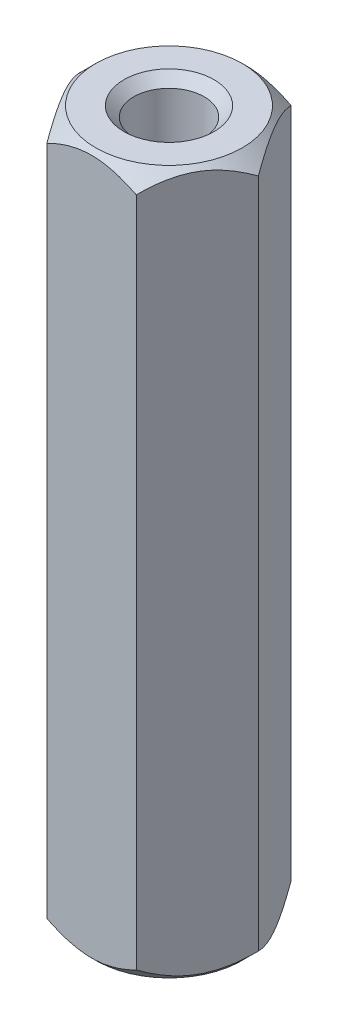
ISO-10303-21;
HEADER;
FILE_DESCRIPTION(('STEP AP214'),'2;1');
FILE_NAME('part.step','',(''),(''),'','','');
FILE_SCHEMA(('AUTOMOTIVE_DESIGN { 1 0 10303 214 1 1 1 1 }'));
ENDSEC;
DATA;
#1=APPLICATION_CONTEXT('core data for automotive mechanical design processes');
#2=APPLICATION_PROTOCOL_DEFINITION('international standard','automotive_design',2000,#1);
#3=PRODUCT_CONTEXT('',#1,'mechanical');
#4=PRODUCT('Part','Part','',(#3));
#5=PRODUCT_RELATED_PRODUCT_CATEGORY('part','',(#4));
#6=PRODUCT_DEFINITION_FORMATION('','',#4);
#7=PRODUCT_DEFINITION_CONTEXT('part definition',#1,'design');
#8=PRODUCT_DEFINITION('design','',#6,#7);
#9=PRODUCT_DEFINITION_SHAPE('','',#8);
#10=(LENGTH_UNIT() NAMED_UNIT(*) SI_UNIT(.MILLI.,.METRE.));
#11=(NAMED_UNIT(*) PLANE_ANGLE_UNIT() SI_UNIT($,.RADIAN.));
#12=(NAMED_UNIT(*) SI_UNIT($,.STERADIAN.) SOLID_ANGLE_UNIT());
#13=UNCERTAINTY_MEASURE_WITH_UNIT(LENGTH_MEASURE(1.E-05),#10,'distance_accuracy_value','');
#14=(GEOMETRIC_REPRESENTATION_CONTEXT(3) GLOBAL_UNCERTAINTY_ASSIGNED_CONTEXT((#13)) GLOBAL_UNIT_ASSIGNED_CONTEXT((#10,
#11,#12)) REPRESENTATION_CONTEXT('',''));
#15=CARTESIAN_POINT('',(0.,0.,0.));
#16=DIRECTION('',(0.,0.,1.));
#17=DIRECTION('',(1.,0.,0.));
#18=AXIS2_PLACEMENT_3D('',#15,#16,#17);
#19=CARTESIAN_POINT('',(3.17542648054294,25.,0.));
#20=DIRECTION('',(-0.866025403784439,0.,0.5));
#21=DIRECTION('',(0.5,0.,0.866025403784439));
#22=AXIS2_PLACEMENT_3D('',#19,#20,#21);
#23=PLANE('',#22);
#24=CARTESIAN_POINT('',(3.17554195059678,24.4244580431051,0.000199999999999451));
#25=CARTESIAN_POINT('',(3.12096451019372,24.4789890063512,-0.0943308997251552));
#26=CARTESIAN_POINT('',(3.06547446347007,24.5303172884173,-0.190442479964885));
#27=CARTESIAN_POINT('',(2.95232415552349,24.6242981519194,-0.386424562220434));
#28=CARTESIAN_POINT('',(2.89465313346251,24.6668984427094,-0.486313702554481));
#29=CARTESIAN_POINT('',(2.77836227110502,24.7398735719351,-0.687735384613654));
#30=CARTESIAN_POINT('',(2.71977204694418,24.7704318303217,-0.78921662968707));
#31=CARTESIAN_POINT('',(2.60130175305013,24.8175131640141,-0.994413197899191));
#32=CARTESIAN_POINT('',(2.54142530239376,24.8340713841007,-1.0981222526129));
#33=CARTESIAN_POINT('',(2.43823122487548,24.8490111921236,-1.27685963791477));
#34=CARTESIAN_POINT('',(2.3950469127149,24.8512227473998,-1.35165706066681));
#35=CARTESIAN_POINT('',(2.30874888176717,24.8474967824125,-1.50112963486143));
#36=CARTESIAN_POINT('',(2.26563519303235,24.8415564052911,-1.57580473425185));
#37=CARTESIAN_POINT('',(2.17981491306543,24.8218646203966,-1.72444981947434));
#38=CARTESIAN_POINT('',(2.13710883164784,24.8081044750726,-1.79841892228177));
#39=CARTESIAN_POINT('',(2.05243516150698,24.7735284813848,-1.94507802102908));
#40=CARTESIAN_POINT('',(2.01046751642766,24.7527131739356,-2.01776811458047));
#41=CARTESIAN_POINT('',(1.902972667594,24.6909197287516,-2.20395465431231));
#42=CARTESIAN_POINT('',(1.83811191884127,24.6452841914761,-2.31629676656899));
#43=CARTESIAN_POINT('',(1.74273981029544,24.5682453606757,-2.48148610419534));
#44=CARTESIAN_POINT('',(1.71131043208802,24.54117749248,-2.53592338410089));
#45=CARTESIAN_POINT('',(1.64903383378715,24.4845743483067,-2.64378961648056));
#46=CARTESIAN_POINT('',(1.61818627041469,24.4550405868641,-2.69721916353136));
#47=CARTESIAN_POINT('',(1.58759777021763,24.4244580431051,-2.7502));
#48=B_SPLINE_CURVE_WITH_KNOTS('',3,(#24,#25,#26,#27,#28,#29,#30,#31,#32,#33,#34,#35,#36,#37,#38,
#39,#40,#41,#42,#43,#44,#45,#46,#47),.UNSPECIFIED.,.F.,.F.,(4,2,2,2,2,2,2,2,2,2,2,4),(0.,
0.366307821078207,0.73474990222977,1.0973403616594,1.45901787214335,1.71784182927396,
1.97675651485028,2.23596107357798,2.49514576375465,2.90682558871159,3.11210731416954,
3.31726387159445),.UNSPECIFIED.);
#49=CARTESIAN_POINT('',(3.17542648054294,24.4245735194571,0.));
#50=VERTEX_POINT('',#49);
#51=CARTESIAN_POINT('',(1.58771324027147,24.4245735194571,-2.75));
#52=VERTEX_POINT('',#51);
#53=EDGE_CURVE('E193',#50,#52,#48,.T.);
#54=ORIENTED_EDGE('',*,*,#53,.F.);
#55=DIRECTION('',(0.,-1.,0.));
#56=VECTOR('',#55,1.);
#57=CARTESIAN_POINT('',(3.17542648054294,25.,0.));
#58=LINE('',#57,#56);
#59=CARTESIAN_POINT('',(3.17542648054294,0.575426480542932,0.));
#60=VERTEX_POINT('',#59);
#61=EDGE_CURVE('E58',#50,#60,#58,.T.);
#62=ORIENTED_EDGE('',*,*,#61,.T.);
#63=CARTESIAN_POINT('',(1.58759777021763,0.575541956894908,-2.7502));
#64=CARTESIAN_POINT('',(1.64217521062069,0.521010993648786,-2.65566910027484));
#65=CARTESIAN_POINT('',(1.69766525734433,0.469682711582689,-2.55955752003512));
#66=CARTESIAN_POINT('',(1.81081556529092,0.375701848080574,-2.36357543777957));
#67=CARTESIAN_POINT('',(1.8684865873519,0.333101557290606,-2.26368629744552));
#68=CARTESIAN_POINT('',(1.98477744970939,0.260126428064943,-2.06226461538635));
#69=CARTESIAN_POINT('',(2.04336767387023,0.229568169678274,-1.96078337031293));
#70=CARTESIAN_POINT('',(2.16183796776428,0.18248683598589,-1.75558680210081));
#71=CARTESIAN_POINT('',(2.22171441842064,0.165928615899292,-1.6518777473871));
#72=CARTESIAN_POINT('',(2.32490849593893,0.150988807876365,-1.47314036208524));
#73=CARTESIAN_POINT('',(2.36809280809951,0.148777252600221,-1.3983429393332));
#74=CARTESIAN_POINT('',(2.45439083904724,0.152503217587472,-1.24887036513858));
#75=CARTESIAN_POINT('',(2.49750452778206,0.158443594708872,-1.17419526574816));
#76=CARTESIAN_POINT('',(2.58332480774898,0.178135379603437,-1.02555018052567));
#77=CARTESIAN_POINT('',(2.62603088916656,0.19189552492741,-0.951581077718235));
#78=CARTESIAN_POINT('',(2.71070455930743,0.226471518615216,-0.804921978970924));
#79=CARTESIAN_POINT('',(2.75267220438674,0.247286826064364,-0.732231885419538));
#80=CARTESIAN_POINT('',(2.86016705322041,0.309080271248451,-0.546045345687696));
#81=CARTESIAN_POINT('',(2.92502780197313,0.35471580852391,-0.433703233431014));
#82=CARTESIAN_POINT('',(3.02039991051896,0.431754639324315,-0.268513895804662));
#83=CARTESIAN_POINT('',(3.05182928872638,0.458822507519961,-0.214076615899113));
#84=CARTESIAN_POINT('',(3.11410588702726,0.515425651693308,-0.106210383519438));
#85=CARTESIAN_POINT('',(3.14495345039972,0.544959413135855,-0.0527808364686397));
#86=CARTESIAN_POINT('',(3.17554195059678,0.575541956894908,0.000199999999999562));
#87=B_SPLINE_CURVE_WITH_KNOTS('',3,(#63,#64,#65,#66,#67,#68,#69,#70,#71,#72,#73,#74,#75,#76,#77,
#78,#79,#80,#81,#82,#83,#84,#85,#86),.UNSPECIFIED.,.F.,.F.,(4,2,2,2,2,2,2,2,2,2,2,4),(0.,
0.366307821078206,0.734749902229767,1.09734036165939,1.45901787214335,1.71784182927396,
1.97675651485027,2.23596107357798,2.49514576375464,2.90682558871159,3.11210731416953,
3.31726387159445),.UNSPECIFIED.);
#88=CARTESIAN_POINT('',(1.58771324027147,0.575426480542932,-2.75));
#89=VERTEX_POINT('',#88);
#90=EDGE_CURVE('E127',#89,#60,#87,.T.);
#91=ORIENTED_EDGE('',*,*,#90,.F.);
#92=DIRECTION('',(0.,-1.,0.));
#93=VECTOR('',#92,1.);
#94=CARTESIAN_POINT('',(1.58771324027147,25.,-2.75));
#95=LINE('',#94,#93);
#96=EDGE_CURVE('E11',#52,#89,#95,.T.);
#97=ORIENTED_EDGE('',*,*,#96,.F.);
#98=EDGE_LOOP('',(#54,#62,#91,#97));
#99=FACE_BOUND('',#98,.T.);
#100=ADVANCED_FACE('F35',(#99),#23,.F.);
#101=CARTESIAN_POINT('',(1.58771324027147,25.,-2.75));
#102=DIRECTION('',(0.,0.,1.));
#103=DIRECTION('',(1.,0.,0.));
#104=AXIS2_PLACEMENT_3D('',#101,#102,#103);
#105=PLANE('',#104);
#106=CARTESIAN_POINT('',(-3.25318446766894,23.340221932931,-2.75));
#107=CARTESIAN_POINT('',(-3.17435132632785,23.4004130612774,-2.75));
#108=CARTESIAN_POINT('',(-3.09508664432669,23.4600480039978,-2.75));
#109=CARTESIAN_POINT('',(-2.93552029499848,23.5779534640375,-2.75));
#110=CARTESIAN_POINT('',(-2.85521838100221,23.6362236471701,-2.75));
#111=CARTESIAN_POINT('',(-2.69281633076979,23.7515622578085,-2.75));
#112=CARTESIAN_POINT('',(-2.6107070916643,23.808617910593,-2.75));
#113=CARTESIAN_POINT('',(-2.44511064746396,23.9206864718193,-2.75));
#114=CARTESIAN_POINT('',(-2.36162353877531,23.9756995223093,-2.75));
#115=CARTESIAN_POINT('',(-2.18790389112894,24.08650082828,-2.75));
#116=CARTESIAN_POINT('',(-2.09757049076991,24.1421317465607,-2.75));
#117=CARTESIAN_POINT('',(-1.91481340119805,24.2498417776052,-2.75));
#118=CARTESIAN_POINT('',(-1.82238998788238,24.3019213555694,-2.75));
#119=CARTESIAN_POINT('',(-1.6354019230151,24.4014391399425,-2.75));
#120=CARTESIAN_POINT('',(-1.54084424527055,24.4488903471598,-2.75));
#121=CARTESIAN_POINT('',(-1.3490933630534,24.5380798463973,-2.75));
#122=CARTESIAN_POINT('',(-1.25190140716265,24.5798207901081,-2.75));
#123=CARTESIAN_POINT('',(-1.06371723723787,24.6525985160094,-2.75));
#124=CARTESIAN_POINT('',(-0.972971140610649,24.6842651782299,-2.75));
#125=CARTESIAN_POINT('',(-0.789218425830063,24.7403290297576,-2.75));
#126=CARTESIAN_POINT('',(-0.696211659611728,24.7647257415166,-2.75));
#127=CARTESIAN_POINT('',(-0.510082611526426,24.8045422828022,-2.75));
#128=CARTESIAN_POINT('',(-0.416994968077464,24.8201213471438,-2.75));
#129=CARTESIAN_POINT('',(-0.229728689201748,24.8419863205344,-2.75));
#130=CARTESIAN_POINT('',(-0.135550267120603,24.8482740169509,-2.75));
#131=CARTESIAN_POINT('',(0.049132532414904,24.8510484151696,-2.75));
#132=CARTESIAN_POINT('',(0.139631188652713,24.8479218469063,-2.75));
#133=CARTESIAN_POINT('',(0.319894261401458,24.8329148434665,-2.75));
#134=CARTESIAN_POINT('',(0.409658608431552,24.8210335893849,-2.75));
#135=CARTESIAN_POINT('',(0.589325943025652,24.7889782763205,-2.75));
#136=CARTESIAN_POINT('',(0.679202808490498,24.7686599869486,-2.75));
#137=CARTESIAN_POINT('',(0.856977323722658,24.7208365857239,-2.75));
#138=CARTESIAN_POINT('',(0.944875107630336,24.6933319625569,-2.75));
#139=CARTESIAN_POINT('',(1.2178117022278,24.5974817056055,-2.75));
#140=CARTESIAN_POINT('',(1.39908624348775,24.5183802224201,-2.75));
#141=CARTESIAN_POINT('',(1.6643778514059,24.3864700289548,-2.75));
#142=CARTESIAN_POINT('',(1.75186873700446,24.3401872657413,-2.75));
#143=CARTESIAN_POINT('',(1.92486730737521,24.2440446048772,-2.75));
#144=CARTESIAN_POINT('',(2.0103753406011,24.1941853421389,-2.75));
#145=CARTESIAN_POINT('',(2.17545095590652,24.0941484078715,-2.75));
#146=CARTESIAN_POINT('',(2.25510307682408,24.0441086598986,-2.75));
#147=CARTESIAN_POINT('',(2.41304093731651,23.9419071055646,-2.75));
#148=CARTESIAN_POINT('',(2.49132657339064,23.8897451394499,-2.75));
#149=CARTESIAN_POINT('',(2.64607675927998,23.7841062512369,-2.75));
#150=CARTESIAN_POINT('',(2.72255090392029,23.7306433262937,-2.75));
#151=CARTESIAN_POINT('',(2.87445148235092,23.6222912546725,-2.75));
#152=CARTESIAN_POINT('',(2.94987819895079,23.5674025049325,-2.75));
#153=CARTESIAN_POINT('',(3.02486603543437,23.5119302192447,-2.75));
#154=B_SPLINE_CURVE_WITH_KNOTS('',3,(#106,#107,#108,#109,#110,#111,#112,#113,#114,#115,#116,
#117,#118,#119,#120,#121,#122,#123,#124,#125,#126,#127,#128,#129,#130,#131,#132,#133,#134,#135,
#136,#137,#138,#139,#140,#141,#142,#143,#144,#145,#146,#147,#148,#149,#150,#151,#152,#153),
.UNSPECIFIED.,.F.,.F.,(4,2,2,2,2,2,2,2,2,2,2,2,2,2,2,2,2,2,2,2,2,2,2,4),(0.,0.297560205375837,
0.595192527837748,0.895126020648953,1.19503861606652,1.51324189540341,1.83140341197327,
2.1486438129796,2.46573639246571,2.75382380349614,3.04193013423482,3.32465250604355,
3.60732048386056,3.87853727370559,4.14977943613652,4.42586290772333,4.70192760994482,
5.29343447193664,5.59034540950354,5.88720376825973,6.169367939813,6.45155339120154,
6.73146312156414,7.01129574525014),.UNSPECIFIED.);
#155=CARTESIAN_POINT('',(-1.58771324027147,24.4245735194571,-2.75));
#156=VERTEX_POINT('',#155);
#157=EDGE_CURVE('E92',#52,#156,#154,.F.);
#158=ORIENTED_EDGE('',*,*,#157,.F.);
#159=ORIENTED_EDGE('',*,*,#96,.T.);
#160=CARTESIAN_POINT('',(-3.25318446766894,1.65977806706902,-2.75));
#161=CARTESIAN_POINT('',(-3.17435132632785,1.59958693872261,-2.75));
#162=CARTESIAN_POINT('',(-3.09508664432669,1.53995199600224,-2.75));
#163=CARTESIAN_POINT('',(-2.93552029499848,1.42204653596247,-2.75));
#164=CARTESIAN_POINT('',(-2.85521838100221,1.36377635282993,-2.75));
#165=CARTESIAN_POINT('',(-2.69281633076979,1.24843774219145,-2.75));
#166=CARTESIAN_POINT('',(-2.6107070916643,1.19138208940703,-2.75));
#167=CARTESIAN_POINT('',(-2.44511064746396,1.07931352818069,-2.75));
#168=CARTESIAN_POINT('',(-2.36162353877531,1.02430047769075,-2.75));
#169=CARTESIAN_POINT('',(-2.18790389112894,0.913499171720041,-2.75));
#170=CARTESIAN_POINT('',(-2.09757049076991,0.857868253439277,-2.75));
#171=CARTESIAN_POINT('',(-1.91481340119805,0.750158222394771,-2.75));
#172=CARTESIAN_POINT('',(-1.82238998788238,0.698078644430596,-2.75));
#173=CARTESIAN_POINT('',(-1.6354019230151,0.598560860057509,-2.75));
#174=CARTESIAN_POINT('',(-1.54084424527055,0.551109652840225,-2.75));
#175=CARTESIAN_POINT('',(-1.3490933630534,0.461920153602751,-2.75));
#176=CARTESIAN_POINT('',(-1.25190140716265,0.420179209891871,-2.75));
#177=CARTESIAN_POINT('',(-1.06371723723787,0.347401483990568,-2.75));
#178=CARTESIAN_POINT('',(-0.972971140610649,0.31573482177011,-2.75));
#179=CARTESIAN_POINT('',(-0.789218425830063,0.259670970242376,-2.75));
#180=CARTESIAN_POINT('',(-0.696211659611728,0.235274258483399,-2.75));
#181=CARTESIAN_POINT('',(-0.510082611526426,0.195457717197765,-2.75));
#182=CARTESIAN_POINT('',(-0.416994968077464,0.179878652856208,-2.75));
#183=CARTESIAN_POINT('',(-0.229728689201749,0.158013679465602,-2.75));
#184=CARTESIAN_POINT('',(-0.135550267120603,0.151725983049063,-2.75));
#185=CARTESIAN_POINT('',(0.0491325324149033,0.148951584830425,-2.75));
#186=CARTESIAN_POINT('',(0.139631188652713,0.152078153093695,-2.75));
#187=CARTESIAN_POINT('',(0.319894261401457,0.16708515653347,-2.75));
#188=CARTESIAN_POINT('',(0.409658608431551,0.178966410615099,-2.75));
#189=CARTESIAN_POINT('',(0.589325943025652,0.211021723679476,-2.75));
#190=CARTESIAN_POINT('',(0.679202808490497,0.231340013051435,-2.75));
#191=CARTESIAN_POINT('',(0.856977323722657,0.27916341427606,-2.75));
#192=CARTESIAN_POINT('',(0.944875107630335,0.306668037443103,-2.75));
#193=CARTESIAN_POINT('',(1.2178117022278,0.402518294394536,-2.75));
#194=CARTESIAN_POINT('',(1.39908624348775,0.48161977757989,-2.75));
#195=CARTESIAN_POINT('',(1.6643778514059,0.613529971045228,-2.75));
#196=CARTESIAN_POINT('',(1.75186873700445,0.659812734258722,-2.75));
#197=CARTESIAN_POINT('',(1.92486730737521,0.755955395122828,-2.75));
#198=CARTESIAN_POINT('',(2.0103753406011,0.805814657861119,-2.75));
#199=CARTESIAN_POINT('',(2.17545095590652,0.905851592128464,-2.75));
#200=CARTESIAN_POINT('',(2.25510307682408,0.955891340101416,-2.75));
#201=CARTESIAN_POINT('',(2.41304093731651,1.05809289443541,-2.75));
#202=CARTESIAN_POINT('',(2.49132657339064,1.11025486055007,-2.75));
#203=CARTESIAN_POINT('',(2.64607675927998,1.21589374876306,-2.75));
#204=CARTESIAN_POINT('',(2.7225509039203,1.26935667370632,-2.75));
#205=CARTESIAN_POINT('',(2.87445148235092,1.37770874532753,-2.75));
#206=CARTESIAN_POINT('',(2.94987819895079,1.43259749506751,-2.75));
#207=CARTESIAN_POINT('',(3.02486603543437,1.48806978075526,-2.75));
#208=B_SPLINE_CURVE_WITH_KNOTS('',3,(#160,#161,#162,#163,#164,#165,#166,#167,#168,#169,#170,
#171,#172,#173,#174,#175,#176,#177,#178,#179,#180,#181,#182,#183,#184,#185,#186,#187,#188,#189,
#190,#191,#192,#193,#194,#195,#196,#197,#198,#199,#200,#201,#202,#203,#204,#205,#206,#207),
.UNSPECIFIED.,.F.,.F.,(4,2,2,2,2,2,2,2,2,2,2,2,2,2,2,2,2,2,2,2,2,2,2,4),(0.,0.297560205375841,
0.59519252783775,0.895126020648954,1.19503861606652,1.51324189540341,1.83140341197328,
2.1486438129796,2.46573639246571,2.75382380349615,3.04193013423482,3.32465250604355,
3.60732048386056,3.87853727370559,4.14977943613652,4.42586290772333,4.70192760994482,
5.29343447193664,5.59034540950354,5.88720376825973,6.169367939813,6.45155339120155,
6.73146312156414,7.01129574525014),.UNSPECIFIED.);
#209=CARTESIAN_POINT('',(-1.58771324027147,0.575426480542932,-2.75));
#210=VERTEX_POINT('',#209);
#211=EDGE_CURVE('E133',#210,#89,#208,.T.);
#212=ORIENTED_EDGE('',*,*,#211,.F.);
#213=DIRECTION('',(0.,-1.,0.));
#214=VECTOR('',#213,1.);
#215=CARTESIAN_POINT('',(-1.58771324027147,25.,-2.75));
#216=LINE('',#215,#214);
#217=EDGE_CURVE('E43',#156,#210,#216,.T.);
#218=ORIENTED_EDGE('',*,*,#217,.F.);
#219=EDGE_LOOP('',(#158,#159,#212,#218));
#220=FACE_BOUND('',#219,.T.);
#221=ADVANCED_FACE('F177',(#220),#105,.F.);
#222=CARTESIAN_POINT('',(-1.58771324027147,25.,-2.75));
#223=DIRECTION('',(0.866025403784439,0.,0.5));
#224=DIRECTION('',(0.5,0.,-0.866025403784439));
#225=AXIS2_PLACEMENT_3D('',#222,#223,#224);
#226=PLANE('',#225);
#227=CARTESIAN_POINT('',(-1.58759777021763,24.4244580431051,-2.7502));
#228=CARTESIAN_POINT('',(-1.64217521062069,24.4789890063512,-2.65566910027484));
#229=CARTESIAN_POINT('',(-1.69766525734434,24.5303172884173,-2.55955752003511));
#230=CARTESIAN_POINT('',(-1.81081556529092,24.6242981519194,-2.36357543777957));
#231=CARTESIAN_POINT('',(-1.8684865873519,24.6668984427094,-2.26368629744552));
#232=CARTESIAN_POINT('',(-1.98477744970939,24.7398735719351,-2.06226461538635));
#233=CARTESIAN_POINT('',(-2.04336767387023,24.7704318303217,-1.96078337031293));
#234=CARTESIAN_POINT('',(-2.16183796776428,24.8175131640141,-1.75558680210081));
#235=CARTESIAN_POINT('',(-2.22171441842064,24.8340713841007,-1.6518777473871));
#236=CARTESIAN_POINT('',(-2.32490849593893,24.8490111921236,-1.47314036208524));
#237=CARTESIAN_POINT('',(-2.36809280809951,24.8512227473998,-1.3983429393332));
#238=CARTESIAN_POINT('',(-2.45439083904724,24.8474967824125,-1.24887036513858));
#239=CARTESIAN_POINT('',(-2.49750452778206,24.8415564052911,-1.17419526574816));
#240=CARTESIAN_POINT('',(-2.58332480774898,24.8218646203966,-1.02555018052566));
#241=CARTESIAN_POINT('',(-2.62603088916656,24.8081044750726,-0.951581077718232));
#242=CARTESIAN_POINT('',(-2.71070455930743,24.7735284813848,-0.804921978970922));
#243=CARTESIAN_POINT('',(-2.75267220438674,24.7527131739356,-0.732231885419535));
#244=CARTESIAN_POINT('',(-2.86016705322041,24.6909197287516,-0.546045345687693));
#245=CARTESIAN_POINT('',(-2.92502780197313,24.6452841914761,-0.433703233431012));
#246=CARTESIAN_POINT('',(-3.02039991051896,24.5682453606757,-0.26851389580466));
#247=CARTESIAN_POINT('',(-3.05182928872638,24.54117749248,-0.214076615899112));
#248=CARTESIAN_POINT('',(-3.11410588702726,24.4845743483067,-0.106210383519437));
#249=CARTESIAN_POINT('',(-3.14495345039972,24.4550405868641,-0.0527808364686385));
#250=CARTESIAN_POINT('',(-3.17554195059678,24.4244580431051,0.000200000000000208));
#251=B_SPLINE_CURVE_WITH_KNOTS('',3,(#227,#228,#229,#230,#231,#232,#233,#234,#235,#236,#237,
#238,#239,#240,#241,#242,#243,#244,#245,#246,#247,#248,#249,#250),.UNSPECIFIED.,.F.,.F.,(4,2,2,
2,2,2,2,2,2,2,2,4),(0.,0.366307821078205,0.734749902229767,1.09734036165939,1.45901787214335,
1.71784182927396,1.97675651485028,2.23596107357798,2.49514576375464,2.90682558871159,
3.11210731416953,3.31726387159444),.UNSPECIFIED.);
#252=CARTESIAN_POINT('',(-3.17542648054294,24.4245735194571,0.));
#253=VERTEX_POINT('',#252);
#254=EDGE_CURVE('E87',#156,#253,#251,.T.);
#255=ORIENTED_EDGE('',*,*,#254,.F.);
#256=ORIENTED_EDGE('',*,*,#217,.T.);
#257=CARTESIAN_POINT('',(-3.17554195059678,0.575541956894907,0.000200000000001098));
#258=CARTESIAN_POINT('',(-3.12096451019372,0.521010993648785,-0.0943308997251537));
#259=CARTESIAN_POINT('',(-3.06547446347007,0.469682711582688,-0.190442479964884));
#260=CARTESIAN_POINT('',(-2.95232415552349,0.375701848080573,-0.386424562220433));
#261=CARTESIAN_POINT('',(-2.89465313346251,0.333101557290605,-0.486313702554479));
#262=CARTESIAN_POINT('',(-2.77836227110502,0.260126428064943,-0.687735384613651));
#263=CARTESIAN_POINT('',(-2.71977204694418,0.229568169678274,-0.789216629687066));
#264=CARTESIAN_POINT('',(-2.60130175305013,0.18248683598589,-0.994413197899185));
#265=CARTESIAN_POINT('',(-2.54142530239377,0.165928615899292,-1.0981222526129));
#266=CARTESIAN_POINT('',(-2.43823122487548,0.150988807876365,-1.27685963791476));
#267=CARTESIAN_POINT('',(-2.3950469127149,0.148777252600221,-1.3516570606668));
#268=CARTESIAN_POINT('',(-2.30874888176717,0.152503217587472,-1.50112963486142));
#269=CARTESIAN_POINT('',(-2.26563519303235,0.158443594708872,-1.57580473425184));
#270=CARTESIAN_POINT('',(-2.17981491306543,0.178135379603437,-1.72444981947433));
#271=CARTESIAN_POINT('',(-2.13710883164785,0.19189552492741,-1.79841892228176));
#272=CARTESIAN_POINT('',(-2.05243516150698,0.226471518615216,-1.94507802102908));
#273=CARTESIAN_POINT('',(-2.01046751642767,0.247286826064364,-2.01776811458046));
#274=CARTESIAN_POINT('',(-1.902972667594,0.309080271248451,-2.2039546543123));
#275=CARTESIAN_POINT('',(-1.83811191884128,0.354715808523911,-2.31629676656898));
#276=CARTESIAN_POINT('',(-1.74273981029545,0.431754639324316,-2.48148610419534));
#277=CARTESIAN_POINT('',(-1.71131043208803,0.458822507519961,-2.53592338410089));
#278=CARTESIAN_POINT('',(-1.64903383378715,0.515425651693308,-2.64378961648056));
#279=CARTESIAN_POINT('',(-1.61818627041469,0.544959413135855,-2.69721916353136));
#280=CARTESIAN_POINT('',(-1.58759777021763,0.575541956894908,-2.7502));
#281=B_SPLINE_CURVE_WITH_KNOTS('',3,(#257,#258,#259,#260,#261,#262,#263,#264,#265,#266,#267,
#268,#269,#270,#271,#272,#273,#274,#275,#276,#277,#278,#279,#280),.UNSPECIFIED.,.F.,.F.,(4,2,2,
2,2,2,2,2,2,2,2,4),(0.,0.366307821078206,0.734749902229767,1.09734036165939,1.45901787214335,
1.71784182927395,1.97675651485027,2.23596107357798,2.49514576375464,2.90682558871159,
3.11210731416953,3.31726387159444),.UNSPECIFIED.);
#282=CARTESIAN_POINT('',(-3.17542648054294,0.575426480542932,0.));
#283=VERTEX_POINT('',#282);
#284=EDGE_CURVE('E108',#283,#210,#281,.T.);
#285=ORIENTED_EDGE('',*,*,#284,.F.);
#286=DIRECTION('',(0.,-1.,0.));
#287=VECTOR('',#286,1.);
#288=CARTESIAN_POINT('',(-3.17542648054294,25.,0.));
#289=LINE('',#288,#287);
#290=EDGE_CURVE('E101',#253,#283,#289,.T.);
#291=ORIENTED_EDGE('',*,*,#290,.F.);
#292=EDGE_LOOP('',(#255,#256,#285,#291));
#293=FACE_BOUND('',#292,.T.);
#294=ADVANCED_FACE('F106',(#293),#226,.F.);
#295=CARTESIAN_POINT('',(-3.17542648054294,25.,0.));
#296=DIRECTION('',(0.866025403784438,0.,-0.5));
#297=DIRECTION('',(-0.5,0.,-0.866025403784438));
#298=AXIS2_PLACEMENT_3D('',#295,#296,#297);
#299=PLANE('',#298);
#300=CARTESIAN_POINT('',(-3.17554195059678,24.4244580431051,-0.000199999999999042));
#301=CARTESIAN_POINT('',(-3.12096451019372,24.4789890063512,0.0943308997251558));
#302=CARTESIAN_POINT('',(-3.06547446347007,24.5303172884173,0.190442479964885));
#303=CARTESIAN_POINT('',(-2.95232415552349,24.6242981519194,0.386424562220433));
#304=CARTESIAN_POINT('',(-2.89465313346251,24.6668984427094,0.48631370255448));
#305=CARTESIAN_POINT('',(-2.77836227110502,24.7398735719351,0.687735384613652));
#306=CARTESIAN_POINT('',(-2.71977204694418,24.7704318303217,0.789216629687068));
#307=CARTESIAN_POINT('',(-2.60130175305013,24.8175131640141,0.994413197899187));
#308=CARTESIAN_POINT('',(-2.54142530239377,24.8340713841007,1.0981222526129));
#309=CARTESIAN_POINT('',(-2.43823122487548,24.8490111921236,1.27685963791476));
#310=CARTESIAN_POINT('',(-2.3950469127149,24.8512227473998,1.3516570606668));
#311=CARTESIAN_POINT('',(-2.30874888176717,24.8474967824125,1.50112963486142));
#312=CARTESIAN_POINT('',(-2.26563519303235,24.8415564052911,1.57580473425184));
#313=CARTESIAN_POINT('',(-2.17981491306543,24.8218646203966,1.72444981947433));
#314=CARTESIAN_POINT('',(-2.13710883164785,24.8081044750726,1.79841892228177));
#315=CARTESIAN_POINT('',(-2.05243516150698,24.7735284813848,1.94507802102908));
#316=CARTESIAN_POINT('',(-2.01046751642767,24.7527131739356,2.01776811458046));
#317=CARTESIAN_POINT('',(-1.902972667594,24.6909197287516,2.2039546543123));
#318=CARTESIAN_POINT('',(-1.83811191884128,24.6452841914761,2.31629676656899));
#319=CARTESIAN_POINT('',(-1.74273981029544,24.5682453606757,2.48148610419534));
#320=CARTESIAN_POINT('',(-1.71131043208802,24.54117749248,2.53592338410089));
#321=CARTESIAN_POINT('',(-1.64903383378715,24.4845743483067,2.64378961648056));
#322=CARTESIAN_POINT('',(-1.61818627041469,24.4550405868641,2.69721916353136));
#323=CARTESIAN_POINT('',(-1.58759777021763,24.4244580431051,2.7502));
#324=B_SPLINE_CURVE_WITH_KNOTS('',3,(#300,#301,#302,#303,#304,#305,#306,#307,#308,#309,#310,
#311,#312,#313,#314,#315,#316,#317,#318,#319,#320,#321,#322,#323),.UNSPECIFIED.,.F.,.F.,(4,2,2,
2,2,2,2,2,2,2,2,4),(0.,0.366307821078205,0.734749902229766,1.09734036165939,1.45901787214335,
1.71784182927396,1.97675651485027,2.23596107357798,2.49514576375464,2.90682558871159,
3.11210731416953,3.31726387159444),.UNSPECIFIED.);
#325=CARTESIAN_POINT('',(-1.58771324027146,24.4245735194571,2.75));
#326=VERTEX_POINT('',#325);
#327=EDGE_CURVE('E90',#253,#326,#324,.T.);
#328=ORIENTED_EDGE('',*,*,#327,.F.);
#329=ORIENTED_EDGE('',*,*,#290,.T.);
#330=CARTESIAN_POINT('',(-1.58759777021763,0.575541956894908,2.7502));
#331=CARTESIAN_POINT('',(-1.64217521062069,0.521010993648786,2.65566910027484));
#332=CARTESIAN_POINT('',(-1.69766525734433,0.469682711582688,2.55955752003512));
#333=CARTESIAN_POINT('',(-1.81081556529092,0.375701848080573,2.36357543777957));
#334=CARTESIAN_POINT('',(-1.8684865873519,0.333101557290605,2.26368629744552));
#335=CARTESIAN_POINT('',(-1.98477744970939,0.260126428064943,2.06226461538635));
#336=CARTESIAN_POINT('',(-2.04336767387023,0.229568169678273,1.96078337031293));
#337=CARTESIAN_POINT('',(-2.16183796776428,0.18248683598589,1.75558680210081));
#338=CARTESIAN_POINT('',(-2.22171441842064,0.165928615899291,1.6518777473871));
#339=CARTESIAN_POINT('',(-2.32490849593893,0.150988807876364,1.47314036208524));
#340=CARTESIAN_POINT('',(-2.36809280809951,0.148777252600221,1.3983429393332));
#341=CARTESIAN_POINT('',(-2.45439083904724,0.152503217587472,1.24887036513858));
#342=CARTESIAN_POINT('',(-2.49750452778206,0.158443594708872,1.17419526574816));
#343=CARTESIAN_POINT('',(-2.58332480774898,0.178135379603437,1.02555018052566));
#344=CARTESIAN_POINT('',(-2.62603088916656,0.19189552492741,0.951581077718233));
#345=CARTESIAN_POINT('',(-2.71070455930743,0.226471518615216,0.804921978970923));
#346=CARTESIAN_POINT('',(-2.75267220438674,0.247286826064364,0.732231885419537));
#347=CARTESIAN_POINT('',(-2.86016705322041,0.309080271248451,0.546045345687695));
#348=CARTESIAN_POINT('',(-2.92502780197313,0.35471580852391,0.433703233431014));
#349=CARTESIAN_POINT('',(-3.02039991051896,0.431754639324315,0.268513895804662));
#350=CARTESIAN_POINT('',(-3.05182928872638,0.45882250751996,0.214076615899113));
#351=CARTESIAN_POINT('',(-3.11410588702726,0.515425651693308,0.106210383519439));
#352=CARTESIAN_POINT('',(-3.14495345039972,0.544959413135854,0.0527808364686403));
#353=CARTESIAN_POINT('',(-3.17554195059678,0.575541956894907,-0.000199999999999003));
#354=B_SPLINE_CURVE_WITH_KNOTS('',3,(#330,#331,#332,#333,#334,#335,#336,#337,#338,#339,#340,
#341,#342,#343,#344,#345,#346,#347,#348,#349,#350,#351,#352,#353),.UNSPECIFIED.,.F.,.F.,(4,2,2,
2,2,2,2,2,2,2,2,4),(0.,0.366307821078207,0.734749902229768,1.09734036165939,1.45901787214335,
1.71784182927396,1.97675651485028,2.23596107357798,2.49514576375464,2.90682558871159,
3.11210731416953,3.31726387159444),.UNSPECIFIED.);
#355=CARTESIAN_POINT('',(-1.58771324027147,0.575426480542932,2.75));
#356=VERTEX_POINT('',#355);
#357=EDGE_CURVE('E166',#356,#283,#354,.T.);
#358=ORIENTED_EDGE('',*,*,#357,.F.);
#359=DIRECTION('',(0.,-1.,0.));
#360=VECTOR('',#359,1.);
#361=CARTESIAN_POINT('',(-1.58771324027147,25.,2.75));
#362=LINE('',#361,#360);
#363=EDGE_CURVE('E103',#326,#356,#362,.T.);
#364=ORIENTED_EDGE('',*,*,#363,.F.);
#365=EDGE_LOOP('',(#328,#329,#358,#364));
#366=FACE_BOUND('',#365,.T.);
#367=ADVANCED_FACE('F99',(#366),#299,.F.);
#368=CARTESIAN_POINT('',(-1.58771324027147,25.,2.75));
#369=DIRECTION('',(0.,0.,-1.));
#370=DIRECTION('',(-1.,0.,0.));
#371=AXIS2_PLACEMENT_3D('',#368,#369,#370);
#372=PLANE('',#371);
#373=CARTESIAN_POINT('',(-3.25318446770071,23.3402219329067,2.75));
#374=CARTESIAN_POINT('',(-3.17435132635871,23.4004130612541,2.75));
#375=CARTESIAN_POINT('',(-3.09508664435664,23.4600480039754,2.75));
#376=CARTESIAN_POINT('',(-2.9355202950266,23.577953464017,2.75));
#377=CARTESIAN_POINT('',(-2.85521838102941,23.6362236471505,2.75));
#378=CARTESIAN_POINT('',(-2.69281633079512,23.7515622577908,2.75));
#379=CARTESIAN_POINT('',(-2.61070709168869,23.8086179105762,2.75));
#380=CARTESIAN_POINT('',(-2.44511064748643,23.9206864718044,2.75));
#381=CARTESIAN_POINT('',(-2.36162353879681,23.9756995222952,2.75));
#382=CARTESIAN_POINT('',(-2.18790389114836,24.0865008282679,2.75));
#383=CARTESIAN_POINT('',(-2.09757049078821,24.1421317465496,2.75));
#384=CARTESIAN_POINT('',(-1.91481340121407,24.2498417775961,2.75));
#385=CARTESIAN_POINT('',(-1.82238998789724,24.3019213555612,2.75));
#386=CARTESIAN_POINT('',(-1.63540192302759,24.4014391399361,2.75));
#387=CARTESIAN_POINT('',(-1.54084424528184,24.4488903471543,2.75));
#388=CARTESIAN_POINT('',(-1.34909336306222,24.5380798463934,2.75));
#389=CARTESIAN_POINT('',(-1.2519014071702,24.579820790105,2.75));
#390=CARTESIAN_POINT('',(-1.06371723724488,24.6525985160069,2.75));
#391=CARTESIAN_POINT('',(-0.972971140618448,24.6842651782273,2.75));
#392=CARTESIAN_POINT('',(-0.789218425839464,24.740329029755,2.75));
#393=CARTESIAN_POINT('',(-0.696211659621945,24.7647257415141,2.75));
#394=CARTESIAN_POINT('',(-0.510082611538248,24.8045422828,2.75));
#395=CARTESIAN_POINT('',(-0.416994968090076,24.8201213471419,2.75));
#396=CARTESIAN_POINT('',(-0.229728689215916,24.8419863205332,2.75));
#397=CARTESIAN_POINT('',(-0.135550267135537,24.8482740169502,2.75));
#398=CARTESIAN_POINT('',(0.0491325323986217,24.8510484151698,2.75));
#399=CARTESIAN_POINT('',(0.139631188635847,24.8479218469071,2.75));
#400=CARTESIAN_POINT('',(0.319894261383486,24.8329148434686,2.75));
#401=CARTESIAN_POINT('',(0.409658608413058,24.8210335893876,2.75));
#402=CARTESIAN_POINT('',(0.589325943006129,24.7889782763246,2.75));
#403=CARTESIAN_POINT('',(0.679202808470468,24.7686599869534,2.75));
#404=CARTESIAN_POINT('',(0.856977323701666,24.7208365857302,2.75));
#405=CARTESIAN_POINT('',(0.94487510760889,24.6933319625639,2.75));
#406=CARTESIAN_POINT('',(1.21781170220175,24.5974817056158,2.75));
#407=CARTESIAN_POINT('',(1.39908624345778,24.5183802224336,2.75));
#408=CARTESIAN_POINT('',(1.66437785137029,24.3864700289732,2.75));
#409=CARTESIAN_POINT('',(1.751868736967,24.3401872657614,2.75));
#410=CARTESIAN_POINT('',(1.92486730733412,24.2440446049007,2.75));
#411=CARTESIAN_POINT('',(2.01037534055823,24.1941853421642,2.75));
#412=CARTESIAN_POINT('',(2.1754509558604,24.0941484079001,2.75));
#413=CARTESIAN_POINT('',(2.25510307677649,24.0441086599288,2.75));
#414=CARTESIAN_POINT('',(2.41304093726601,23.9419071055979,2.75));
#415=CARTESIAN_POINT('',(2.4913265733387,23.8897451394848,2.75));
#416=CARTESIAN_POINT('',(2.64607675922519,23.7841062512749,2.75));
#417=CARTESIAN_POINT('',(2.7225509038641,23.7306433263332,2.75));
#418=CARTESIAN_POINT('',(2.87445148229192,23.6222912547151,2.75));
#419=CARTESIAN_POINT('',(2.94987819889039,23.5674025049767,2.75));
#420=CARTESIAN_POINT('',(3.02486603537257,23.5119302192905,2.75));
#421=B_SPLINE_CURVE_WITH_KNOTS('',3,(#373,#374,#375,#376,#377,#378,#379,#380,#381,#382,#383,
#384,#385,#386,#387,#388,#389,#390,#391,#392,#393,#394,#395,#396,#397,#398,#399,#400,#401,#402,
#403,#404,#405,#406,#407,#408,#409,#410,#411,#412,#413,#414,#415,#416,#417,#418,#419,#420),
.UNSPECIFIED.,.F.,.F.,(4,2,2,2,2,2,2,2,2,2,2,2,2,2,2,2,2,2,2,2,2,2,2,4),(0.,0.297560205379707,
0.595192527845487,0.895126020660634,1.19503861608215,1.51324189542346,1.83140341199776,
2.14864381300849,2.46573639249898,2.75382380352712,3.04193013426351,3.32465250607005,
3.60732048388487,3.87853727372809,4.14977943615721,4.42586290774207,4.70192760996161,
5.29343447193898,5.59034540949861,5.88720376824753,6.16936793979459,6.45155339117692,
6.73146312153338,7.01129574521325),.UNSPECIFIED.);
#422=CARTESIAN_POINT('',(1.58771324027147,24.4245735194571,2.75));
#423=VERTEX_POINT('',#422);
#424=EDGE_CURVE('E50',#326,#423,#421,.T.);
#425=ORIENTED_EDGE('',*,*,#424,.F.);
#426=ORIENTED_EDGE('',*,*,#363,.T.);
#427=CARTESIAN_POINT('',(-3.25318446770071,1.65977806709328,2.75));
#428=CARTESIAN_POINT('',(-3.17435132635871,1.59958693874594,2.75));
#429=CARTESIAN_POINT('',(-3.09508664435664,1.53995199602463,2.75));
#430=CARTESIAN_POINT('',(-2.9355202950266,1.42204653598299,2.75));
#431=CARTESIAN_POINT('',(-2.85521838102941,1.36377635284952,2.75));
#432=CARTESIAN_POINT('',(-2.69281633079512,1.24843774220918,2.75));
#433=CARTESIAN_POINT('',(-2.61070709168869,1.19138208942381,2.75));
#434=CARTESIAN_POINT('',(-2.44511064748643,1.07931352819561,2.75));
#435=CARTESIAN_POINT('',(-2.36162353879681,1.02430047770475,2.75));
#436=CARTESIAN_POINT('',(-2.18790389114836,0.913499171732123,2.75));
#437=CARTESIAN_POINT('',(-2.09757049078821,0.857868253450362,2.75));
#438=CARTESIAN_POINT('',(-1.91481340121407,0.750158222403909,2.75));
#439=CARTESIAN_POINT('',(-1.82238998789724,0.698078644438785,2.75));
#440=CARTESIAN_POINT('',(-1.63540192302759,0.598560860063876,2.75));
#441=CARTESIAN_POINT('',(-1.54084424528183,0.551109652845719,2.75));
#442=CARTESIAN_POINT('',(-1.34909336306221,0.461920153606609,2.75));
#443=CARTESIAN_POINT('',(-1.2519014071702,0.420179209894968,2.75));
#444=CARTESIAN_POINT('',(-1.06371723724488,0.347401483993121,2.75));
#445=CARTESIAN_POINT('',(-0.972971140618448,0.315734821772739,2.75));
#446=CARTESIAN_POINT('',(-0.789218425839465,0.259670970244997,2.75));
#447=CARTESIAN_POINT('',(-0.696211659621946,0.235274258485937,2.75));
#448=CARTESIAN_POINT('',(-0.510082611538249,0.195457717199949,2.75));
#449=CARTESIAN_POINT('',(-0.416994968090077,0.179878652858128,2.75));
#450=CARTESIAN_POINT('',(-0.229728689215917,0.15801367946681,2.75));
#451=CARTESIAN_POINT('',(-0.135550267135538,0.151725983049824,2.75));
#452=CARTESIAN_POINT('',(0.0491325323986205,0.148951584830155,2.75));
#453=CARTESIAN_POINT('',(0.139631188635846,0.152078153092856,2.75));
#454=CARTESIAN_POINT('',(0.319894261383484,0.167085156531409,2.75));
#455=CARTESIAN_POINT('',(0.409658608413056,0.178966410612384,2.75));
#456=CARTESIAN_POINT('',(0.589325943006127,0.211021723675396,2.75));
#457=CARTESIAN_POINT('',(0.679202808470466,0.231340013046639,2.75));
#458=CARTESIAN_POINT('',(0.856977323701664,0.27916341426982,2.75));
#459=CARTESIAN_POINT('',(0.944875107608888,0.306668037436135,2.75));
#460=CARTESIAN_POINT('',(1.21781170220175,0.402518294384172,2.75));
#461=CARTESIAN_POINT('',(1.39908624345778,0.481619777566408,2.75));
#462=CARTESIAN_POINT('',(1.66437785137029,0.613529971026814,2.75));
#463=CARTESIAN_POINT('',(1.751868736967,0.659812734238616,2.75));
#464=CARTESIAN_POINT('',(1.92486730733412,0.755955395099282,2.75));
#465=CARTESIAN_POINT('',(2.01037534055823,0.805814657835827,2.75));
#466=CARTESIAN_POINT('',(2.1754509558604,0.905851592099856,2.75));
#467=CARTESIAN_POINT('',(2.25510307677649,0.955891340071246,2.75));
#468=CARTESIAN_POINT('',(2.41304093726601,1.05809289440211,2.75));
#469=CARTESIAN_POINT('',(2.4913265733387,1.1102548605152,2.75));
#470=CARTESIAN_POINT('',(2.64607675922519,1.21589374872507,2.75));
#471=CARTESIAN_POINT('',(2.7225509038641,1.26935667366678,2.75));
#472=CARTESIAN_POINT('',(2.87445148229191,1.37770874528489,2.75));
#473=CARTESIAN_POINT('',(2.94987819889039,1.43259749502332,2.75));
#474=CARTESIAN_POINT('',(3.02486603537257,1.48806978070952,2.75));
#475=B_SPLINE_CURVE_WITH_KNOTS('',3,(#427,#428,#429,#430,#431,#432,#433,#434,#435,#436,#437,
#438,#439,#440,#441,#442,#443,#444,#445,#446,#447,#448,#449,#450,#451,#452,#453,#454,#455,#456,
#457,#458,#459,#460,#461,#462,#463,#464,#465,#466,#467,#468,#469,#470,#471,#472,#473,#474),
.UNSPECIFIED.,.F.,.F.,(4,2,2,2,2,2,2,2,2,2,2,2,2,2,2,2,2,2,2,2,2,2,2,4),(0.,0.297560205379709,
0.595192527845488,0.895126020660636,1.19503861608215,1.51324189542347,1.83140341199777,
2.14864381300849,2.46573639249899,2.75382380352712,3.04193013426351,3.32465250607005,
3.60732048388487,3.87853727372809,4.14977943615721,4.42586290774207,4.70192760996161,
5.29343447193898,5.59034540949861,5.88720376824753,6.16936793979459,6.45155339117692,
6.73146312153338,7.01129574521325),.UNSPECIFIED.);
#476=CARTESIAN_POINT('',(1.58771324027147,0.575426480542932,2.75));
#477=VERTEX_POINT('',#476);
#478=EDGE_CURVE('E159',#477,#356,#475,.F.);
#479=ORIENTED_EDGE('',*,*,#478,.F.);
#480=DIRECTION('',(0.,-1.,0.));
#481=VECTOR('',#480,1.);
#482=CARTESIAN_POINT('',(1.58771324027147,25.,2.75));
#483=LINE('',#482,#481);
#484=EDGE_CURVE('E110',#423,#477,#483,.T.);
#485=ORIENTED_EDGE('',*,*,#484,.F.);
#486=EDGE_LOOP('',(#425,#426,#479,#485));
#487=FACE_BOUND('',#486,.T.);
#488=ADVANCED_FACE('F214',(#487),#372,.F.);
#489=CARTESIAN_POINT('',(1.58771324027147,25.,2.75));
#490=DIRECTION('',(-0.866025403784439,0.,-0.5));
#491=DIRECTION('',(-0.5,0.,0.866025403784439));
#492=AXIS2_PLACEMENT_3D('',#489,#490,#491);
#493=PLANE('',#492);
#494=CARTESIAN_POINT('',(1.58759777021763,24.4244580431051,2.7502));
#495=CARTESIAN_POINT('',(1.64217521062069,24.4789890063512,2.65566910027484));
#496=CARTESIAN_POINT('',(1.69766525734434,24.5303172884173,2.55955752003512));
#497=CARTESIAN_POINT('',(1.81081556529092,24.6242981519194,2.36357543777957));
#498=CARTESIAN_POINT('',(1.8684865873519,24.6668984427094,2.26368629744552));
#499=CARTESIAN_POINT('',(1.9847774497094,24.7398735719351,2.06226461538634));
#500=CARTESIAN_POINT('',(2.04336767387023,24.7704318303217,1.96078337031293));
#501=CARTESIAN_POINT('',(2.16183796776428,24.8175131640141,1.75558680210081));
#502=CARTESIAN_POINT('',(2.22171441842065,24.8340713841007,1.6518777473871));
#503=CARTESIAN_POINT('',(2.32490849593893,24.8490111921236,1.47314036208523));
#504=CARTESIAN_POINT('',(2.36809280809951,24.8512227473998,1.39834293933319));
#505=CARTESIAN_POINT('',(2.45439083904724,24.8474967824125,1.24887036513857));
#506=CARTESIAN_POINT('',(2.49750452778206,24.8415564052911,1.17419526574815));
#507=CARTESIAN_POINT('',(2.58332480774898,24.8218646203966,1.02555018052566));
#508=CARTESIAN_POINT('',(2.62603088916657,24.8081044750726,0.951581077718229));
#509=CARTESIAN_POINT('',(2.71070455930743,24.7735284813848,0.804921978970919));
#510=CARTESIAN_POINT('',(2.75267220438675,24.7527131739356,0.732231885419532));
#511=CARTESIAN_POINT('',(2.86016705322041,24.6909197287516,0.546045345687691));
#512=CARTESIAN_POINT('',(2.92502780197314,24.6452841914761,0.43370323343101));
#513=CARTESIAN_POINT('',(3.02039991051897,24.5682453606757,0.268513895804659));
#514=CARTESIAN_POINT('',(3.05182928872638,24.54117749248,0.214076615899111));
#515=CARTESIAN_POINT('',(3.11410588702726,24.4845743483067,0.106210383519436));
#516=CARTESIAN_POINT('',(3.14495345039972,24.4550405868641,0.052780836468638));
#517=CARTESIAN_POINT('',(3.17554195059678,24.4244580431051,-0.000200000000000695));
#518=B_SPLINE_CURVE_WITH_KNOTS('',3,(#494,#495,#496,#497,#498,#499,#500,#501,#502,#503,#504,
#505,#506,#507,#508,#509,#510,#511,#512,#513,#514,#515,#516,#517),.UNSPECIFIED.,.F.,.F.,(4,2,2,
2,2,2,2,2,2,2,2,4),(0.,0.366307821078207,0.73474990222977,1.0973403616594,1.45901787214335,
1.71784182927396,1.97675651485028,2.23596107357798,2.49514576375464,2.90682558871159,
3.11210731416953,3.31726387159444),.UNSPECIFIED.);
#519=EDGE_CURVE('E212',#423,#50,#518,.T.);
#520=ORIENTED_EDGE('',*,*,#519,.F.);
#521=ORIENTED_EDGE('',*,*,#484,.T.);
#522=CARTESIAN_POINT('',(3.17554195059678,0.575541956894907,-0.000200000000000549));
#523=CARTESIAN_POINT('',(3.12096451019372,0.521010993648786,0.0943308997251542));
#524=CARTESIAN_POINT('',(3.06547446347007,0.469682711582688,0.190442479964884));
#525=CARTESIAN_POINT('',(2.95232415552349,0.375701848080573,0.386424562220433));
#526=CARTESIAN_POINT('',(2.89465313346251,0.333101557290605,0.48631370255448));
#527=CARTESIAN_POINT('',(2.77836227110502,0.260126428064943,0.687735384613653));
#528=CARTESIAN_POINT('',(2.71977204694418,0.229568169678274,0.789216629687068));
#529=CARTESIAN_POINT('',(2.60130175305013,0.18248683598589,0.994413197899187));
#530=CARTESIAN_POINT('',(2.54142530239377,0.165928615899292,1.0981222526129));
#531=CARTESIAN_POINT('',(2.43823122487548,0.150988807876365,1.27685963791476));
#532=CARTESIAN_POINT('',(2.3950469127149,0.148777252600222,1.3516570606668));
#533=CARTESIAN_POINT('',(2.30874888176717,0.152503217587473,1.50112963486142));
#534=CARTESIAN_POINT('',(2.26563519303235,0.158443594708873,1.57580473425184));
#535=CARTESIAN_POINT('',(2.17981491306543,0.178135379603438,1.72444981947433));
#536=CARTESIAN_POINT('',(2.13710883164785,0.191895524927411,1.79841892228177));
#537=CARTESIAN_POINT('',(2.05243516150698,0.226471518615217,1.94507802102908));
#538=CARTESIAN_POINT('',(2.01046751642767,0.247286826064365,2.01776811458046));
#539=CARTESIAN_POINT('',(1.902972667594,0.309080271248453,2.20395465431231));
#540=CARTESIAN_POINT('',(1.83811191884128,0.354715808523912,2.31629676656899));
#541=CARTESIAN_POINT('',(1.74273981029545,0.431754639324317,2.48148610419534));
#542=CARTESIAN_POINT('',(1.71131043208803,0.458822507519962,2.53592338410089));
#543=CARTESIAN_POINT('',(1.64903383378715,0.515425651693309,2.64378961648056));
#544=CARTESIAN_POINT('',(1.61818627041469,0.544959413135856,2.69721916353136));
#545=CARTESIAN_POINT('',(1.58759777021763,0.575541956894909,2.7502));
#546=B_SPLINE_CURVE_WITH_KNOTS('',3,(#522,#523,#524,#525,#526,#527,#528,#529,#530,#531,#532,
#533,#534,#535,#536,#537,#538,#539,#540,#541,#542,#543,#544,#545),.UNSPECIFIED.,.F.,.F.,(4,2,2,
2,2,2,2,2,2,2,2,4),(0.,0.366307821078206,0.734749902229768,1.09734036165939,1.45901787214335,
1.71784182927396,1.97675651485027,2.23596107357798,2.49514576375464,2.90682558871159,
3.11210731416953,3.31726387159444),.UNSPECIFIED.);
#547=EDGE_CURVE('E150',#60,#477,#546,.T.);
#548=ORIENTED_EDGE('',*,*,#547,.F.);
#549=ORIENTED_EDGE('',*,*,#61,.F.);
#550=EDGE_LOOP('',(#520,#521,#548,#549));
#551=FACE_BOUND('',#550,.T.);
#552=ADVANCED_FACE('F210',(#551),#493,.F.);
#553=CARTESIAN_POINT('',(0.,25.,0.));
#554=DIRECTION('',(0.,1.,0.));
#555=DIRECTION('',(0.,0.,1.));
#556=AXIS2_PLACEMENT_3D('',#553,#554,#555);
#557=PLANE('',#556);
#558=CARTESIAN_POINT('',(0.,25.,0.));
#559=DIRECTION('',(0.,1.,0.));
#560=DIRECTION('',(0.,0.,1.));
#561=AXIS2_PLACEMENT_3D('',#558,#559,#560);
#562=CIRCLE('',#561,1.6);
#563=CARTESIAN_POINT('',(0.,25.,1.6));
#564=VERTEX_POINT('',#563);
#565=EDGE_CURVE('E121',#564,#564,#562,.T.);
#566=ORIENTED_EDGE('',*,*,#565,.F.);
#567=EDGE_LOOP('',(#566));
#568=FACE_BOUND('',#567,.T.);
#569=CARTESIAN_POINT('',(0.,25.,0.));
#570=DIRECTION('',(0.,1.,0.));
#571=DIRECTION('',(-1.,0.,0.));
#572=AXIS2_PLACEMENT_3D('',#569,#570,#571);
#573=CIRCLE('',#572,2.6);
#574=CARTESIAN_POINT('',(-2.6,25.,0.));
#575=VERTEX_POINT('',#574);
#576=EDGE_CURVE('E215',#575,#575,#573,.T.);
#577=ORIENTED_EDGE('',*,*,#576,.T.);
#578=EDGE_LOOP('',(#577));
#579=FACE_BOUND('',#578,.T.);
#580=ADVANCED_FACE('F230',(#568,#579),#557,.T.);
#581=CARTESIAN_POINT('',(0.,0.,0.));
#582=DIRECTION('',(0.,1.,0.));
#583=DIRECTION('',(0.,0.,1.));
#584=AXIS2_PLACEMENT_3D('',#581,#582,#583);
#585=PLANE('',#584);
#586=CARTESIAN_POINT('',(0.,0.,0.));
#587=DIRECTION('',(0.,1.,0.));
#588=DIRECTION('',(0.,0.,1.));
#589=AXIS2_PLACEMENT_3D('',#586,#587,#588);
#590=CIRCLE('',#589,1.59999999999999);
#591=CARTESIAN_POINT('',(0.,0.,1.59999999999999));
#592=VERTEX_POINT('',#591);
#593=EDGE_CURVE('E124',#592,#592,#590,.T.);
#594=ORIENTED_EDGE('',*,*,#593,.T.);
#595=EDGE_LOOP('',(#594));
#596=FACE_BOUND('',#595,.T.);
#597=CARTESIAN_POINT('',(0.,0.,0.));
#598=DIRECTION('',(0.,1.,0.));
#599=DIRECTION('',(-1.,0.,0.));
#600=AXIS2_PLACEMENT_3D('',#597,#598,#599);
#601=CIRCLE('',#600,2.6);
#602=CARTESIAN_POINT('',(-2.6,0.,0.));
#603=VERTEX_POINT('',#602);
#604=EDGE_CURVE('E197',#603,#603,#601,.T.);
#605=ORIENTED_EDGE('',*,*,#604,.F.);
#606=EDGE_LOOP('',(#605));
#607=FACE_BOUND('',#606,.T.);
#608=ADVANCED_FACE('F231',(#596,#607),#585,.F.);
#609=CARTESIAN_POINT('',(0.,0.350000000000007,0.));
#610=DIRECTION('',(0.,-1.,0.));
#611=DIRECTION('',(0.,0.,-1.));
#612=AXIS2_PLACEMENT_3D('',#609,#610,#611);
#613=CONICAL_SURFACE('',#612,1.24999999999999,0.785398163397444);
#614=ORIENTED_EDGE('',*,*,#593,.F.);
#615=EDGE_LOOP('',(#614));
#616=FACE_BOUND('',#615,.T.);
#617=CARTESIAN_POINT('',(0.,0.350000000000007,0.));
#618=DIRECTION('',(0.,1.,0.));
#619=DIRECTION('',(0.,0.,1.));
#620=AXIS2_PLACEMENT_3D('',#617,#618,#619);
#621=CIRCLE('',#620,1.24999999999999);
#622=CARTESIAN_POINT('',(0.,0.350000000000007,1.24999999999999));
#623=VERTEX_POINT('',#622);
#624=EDGE_CURVE('E115',#623,#623,#621,.T.);
#625=ORIENTED_EDGE('',*,*,#624,.T.);
#626=EDGE_LOOP('',(#625));
#627=FACE_BOUND('',#626,.T.);
#628=ADVANCED_FACE('F235',(#616,#627),#613,.F.);
#629=CARTESIAN_POINT('',(0.,25.,0.));
#630=DIRECTION('',(0.,1.,0.));
#631=DIRECTION('',(0.,0.,1.));
#632=AXIS2_PLACEMENT_3D('',#629,#630,#631);
#633=CYLINDRICAL_SURFACE('',#632,1.25);
#634=ORIENTED_EDGE('',*,*,#624,.F.);
#635=EDGE_LOOP('',(#634));
#636=FACE_BOUND('',#635,.T.);
#637=CARTESIAN_POINT('',(0.,24.65,0.));
#638=DIRECTION('',(0.,1.,0.));
#639=DIRECTION('',(0.,0.,1.));
#640=AXIS2_PLACEMENT_3D('',#637,#638,#639);
#641=CIRCLE('',#640,1.25);
#642=CARTESIAN_POINT('',(0.,24.65,1.25));
#643=VERTEX_POINT('',#642);
#644=EDGE_CURVE('E118',#643,#643,#641,.T.);
#645=ORIENTED_EDGE('',*,*,#644,.T.);
#646=EDGE_LOOP('',(#645));
#647=FACE_BOUND('',#646,.T.);
#648=ADVANCED_FACE('F241',(#636,#647),#633,.F.);
#649=CARTESIAN_POINT('',(0.,25.,0.));
#650=DIRECTION('',(0.,1.,0.));
#651=DIRECTION('',(0.,0.,1.));
#652=AXIS2_PLACEMENT_3D('',#649,#650,#651);
#653=CONICAL_SURFACE('',#652,1.6,0.785398163397453);
#654=ORIENTED_EDGE('',*,*,#644,.F.);
#655=EDGE_LOOP('',(#654));
#656=FACE_BOUND('',#655,.T.);
#657=ORIENTED_EDGE('',*,*,#565,.T.);
#658=EDGE_LOOP('',(#657));
#659=FACE_BOUND('',#658,.T.);
#660=ADVANCED_FACE('F143',(#656,#659),#653,.F.);
#661=CARTESIAN_POINT('',(0.,0.575426480542932,0.));
#662=DIRECTION('',(0.,1.,0.));
#663=DIRECTION('',(-1.,0.,0.));
#664=AXIS2_PLACEMENT_3D('',#661,#662,#663);
#665=CONICAL_SURFACE('',#664,3.17542648054294,0.785398163397453);
#666=ORIENTED_EDGE('',*,*,#604,.T.);
#667=EDGE_LOOP('',(#666));
#668=FACE_BOUND('',#667,.T.);
#669=ORIENTED_EDGE('',*,*,#90,.T.);
#670=ORIENTED_EDGE('',*,*,#547,.T.);
#671=ORIENTED_EDGE('',*,*,#478,.T.);
#672=ORIENTED_EDGE('',*,*,#357,.T.);
#673=ORIENTED_EDGE('',*,*,#284,.T.);
#674=ORIENTED_EDGE('',*,*,#211,.T.);
#675=EDGE_LOOP('',(#669,#670,#671,#672,#673,#674));
#676=FACE_BOUND('',#675,.T.);
#677=ADVANCED_FACE('F138',(#668,#676),#665,.T.);
#678=CARTESIAN_POINT('',(0.,25.,0.));
#679=DIRECTION('',(0.,-1.,0.));
#680=DIRECTION('',(1.,0.,0.));
#681=AXIS2_PLACEMENT_3D('',#678,#679,#680);
#682=CONICAL_SURFACE('',#681,2.6,0.785398163397453);
#683=ORIENTED_EDGE('',*,*,#576,.F.);
#684=EDGE_LOOP('',(#683));
#685=FACE_BOUND('',#684,.T.);
#686=ORIENTED_EDGE('',*,*,#53,.T.);
#687=ORIENTED_EDGE('',*,*,#157,.T.);
#688=ORIENTED_EDGE('',*,*,#254,.T.);
#689=ORIENTED_EDGE('',*,*,#327,.T.);
#690=ORIENTED_EDGE('',*,*,#424,.T.);
#691=ORIENTED_EDGE('',*,*,#519,.T.);
#692=EDGE_LOOP('',(#686,#687,#688,#689,#690,#691));
#693=FACE_BOUND('',#692,.T.);
#694=ADVANCED_FACE('F89',(#685,#693),#682,.T.);
#695=CLOSED_SHELL('',(#100,#221,#294,#367,#488,#552,#580,#608,#628,#648,#660,#677,#694));
#696=MANIFOLD_SOLID_BREP('B2',#695);
#697=ADVANCED_BREP_SHAPE_REPRESENTATION('',(#18,#696),#14);
#698=SHAPE_DEFINITION_REPRESENTATION(#9,#697);
ENDSEC;
END-ISO-10303-21;
